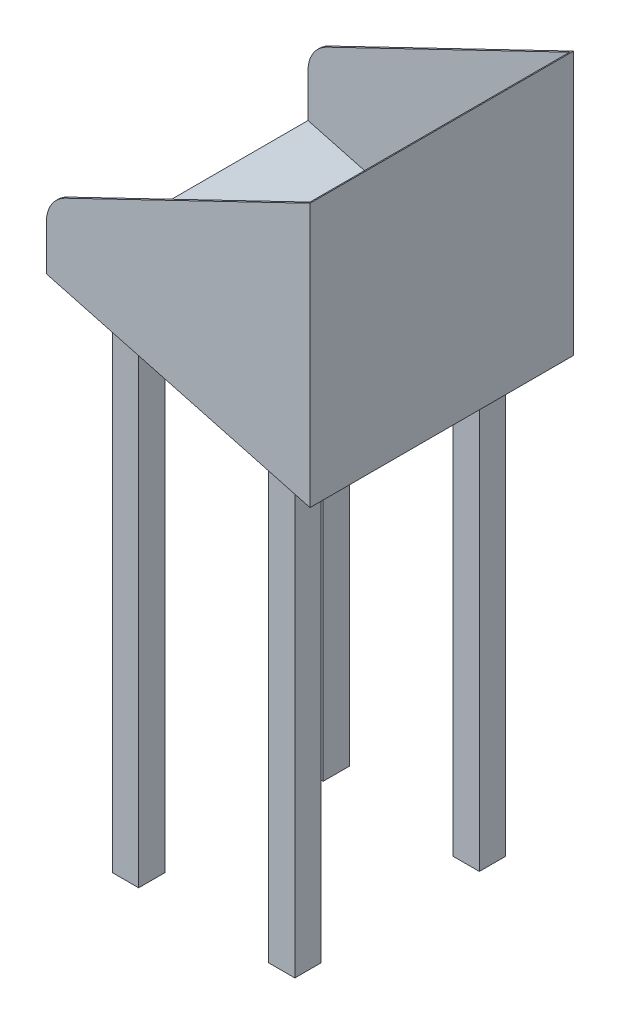
ISO-10303-21;
HEADER;
FILE_DESCRIPTION(('STEP AP214'),'2;1');
FILE_NAME('part.step','',(''),(''),'','','');
FILE_SCHEMA(('AUTOMOTIVE_DESIGN { 1 0 10303 214 1 1 1 1 }'));
ENDSEC;
DATA;
#1=APPLICATION_CONTEXT('core data for automotive mechanical design processes');
#2=APPLICATION_PROTOCOL_DEFINITION('international standard','automotive_design',2000,#1);
#3=PRODUCT_CONTEXT('',#1,'mechanical');
#4=PRODUCT('Part','Part','',(#3));
#5=PRODUCT_RELATED_PRODUCT_CATEGORY('part','',(#4));
#6=PRODUCT_DEFINITION_FORMATION('','',#4);
#7=PRODUCT_DEFINITION_CONTEXT('part definition',#1,'design');
#8=PRODUCT_DEFINITION('design','',#6,#7);
#9=PRODUCT_DEFINITION_SHAPE('','',#8);
#10=(LENGTH_UNIT() NAMED_UNIT(*) SI_UNIT(.MILLI.,.METRE.));
#11=(NAMED_UNIT(*) PLANE_ANGLE_UNIT() SI_UNIT($,.RADIAN.));
#12=(NAMED_UNIT(*) SI_UNIT($,.STERADIAN.) SOLID_ANGLE_UNIT());
#13=UNCERTAINTY_MEASURE_WITH_UNIT(LENGTH_MEASURE(1.E-05),#10,'distance_accuracy_value','');
#14=(GEOMETRIC_REPRESENTATION_CONTEXT(3) GLOBAL_UNCERTAINTY_ASSIGNED_CONTEXT((#13)) GLOBAL_UNIT_ASSIGNED_CONTEXT((#10,
#11,#12)) REPRESENTATION_CONTEXT('',''));
#15=CARTESIAN_POINT('',(0.,0.,0.));
#16=DIRECTION('',(0.,0.,1.));
#17=DIRECTION('',(1.,0.,0.));
#18=AXIS2_PLACEMENT_3D('',#15,#16,#17);
#19=CARTESIAN_POINT('',(-350.,175.77606946893,400.));
#20=DIRECTION('',(0.,0.,1.));
#21=DIRECTION('',(1.,0.,0.));
#22=AXIS2_PLACEMENT_3D('',#19,#20,#21);
#23=CYLINDRICAL_SURFACE('',#22,50.);
#24=DIRECTION('',(0.,0.,1.));
#25=VECTOR('',#24,1.);
#26=CARTESIAN_POINT('',(-371.711595290038,220.816125307723,400.));
#27=LINE('',#26,#25);
#28=CARTESIAN_POINT('',(-371.711595290038,220.816125307723,0.));
#29=VERTEX_POINT('',#28);
#30=CARTESIAN_POINT('',(-371.711595290038,220.816125307723,3.));
#31=VERTEX_POINT('',#30);
#32=EDGE_CURVE('E409',#29,#31,#27,.T.);
#33=ORIENTED_EDGE('',*,*,#32,.F.);
#34=CARTESIAN_POINT('',(-350.,175.77606946893,0.));
#35=DIRECTION('',(0.,0.,-1.));
#36=DIRECTION('',(-1.,0.,0.));
#37=AXIS2_PLACEMENT_3D('',#34,#35,#36);
#38=CIRCLE('',#37,50.);
#39=CARTESIAN_POINT('',(-400.,175.77606946893,0.));
#40=VERTEX_POINT('',#39);
#41=EDGE_CURVE('E40',#40,#29,#38,.T.);
#42=ORIENTED_EDGE('',*,*,#41,.F.);
#43=DIRECTION('',(0.,0.,1.));
#44=VECTOR('',#43,1.);
#45=CARTESIAN_POINT('',(-400.,175.77606946893,400.));
#46=LINE('',#45,#44);
#47=CARTESIAN_POINT('',(-400.,175.77606946893,3.));
#48=VERTEX_POINT('',#47);
#49=EDGE_CURVE('E412',#48,#40,#46,.F.);
#50=ORIENTED_EDGE('',*,*,#49,.F.);
#51=CARTESIAN_POINT('',(-350.,175.77606946893,3.));
#52=DIRECTION('',(0.,0.,-1.));
#53=DIRECTION('',(-1.,0.,0.));
#54=AXIS2_PLACEMENT_3D('',#51,#52,#53);
#55=CIRCLE('',#54,50.);
#56=EDGE_CURVE('E11',#31,#48,#55,.F.);
#57=ORIENTED_EDGE('',*,*,#56,.F.);
#58=EDGE_LOOP('',(#33,#42,#50,#57));
#59=FACE_BOUND('',#58,.T.);
#60=ADVANCED_FACE('F33',(#59),#23,.T.);
#61=CARTESIAN_POINT('',(-350.,175.77606946893,400.));
#62=DIRECTION('',(0.,0.,-1.));
#63=DIRECTION('',(-1.,0.,0.));
#64=AXIS2_PLACEMENT_3D('',#61,#62,#63);
#65=CYLINDRICAL_SURFACE('',#64,50.);
#66=DIRECTION('',(0.,0.,-1.));
#67=VECTOR('',#66,1.);
#68=CARTESIAN_POINT('',(-400.,175.77606946893,400.));
#69=LINE('',#68,#67);
#70=CARTESIAN_POINT('',(-400.,175.77606946893,400.));
#71=VERTEX_POINT('',#70);
#72=CARTESIAN_POINT('',(-400.,175.77606946893,397.));
#73=VERTEX_POINT('',#72);
#74=EDGE_CURVE('E398',#71,#73,#69,.T.);
#75=ORIENTED_EDGE('',*,*,#74,.F.);
#76=CARTESIAN_POINT('',(-350.,175.77606946893,400.));
#77=DIRECTION('',(0.,0.,-1.));
#78=DIRECTION('',(-1.,0.,0.));
#79=AXIS2_PLACEMENT_3D('',#76,#77,#78);
#80=CIRCLE('',#79,50.);
#81=CARTESIAN_POINT('',(-371.711595290038,220.816125307723,400.));
#82=VERTEX_POINT('',#81);
#83=EDGE_CURVE('E407',#82,#71,#80,.F.);
#84=ORIENTED_EDGE('',*,*,#83,.F.);
#85=DIRECTION('',(0.,0.,-1.));
#86=VECTOR('',#85,1.);
#87=CARTESIAN_POINT('',(-371.711595290038,220.816125307723,400.));
#88=LINE('',#87,#86);
#89=CARTESIAN_POINT('',(-371.711595290038,220.816125307723,397.));
#90=VERTEX_POINT('',#89);
#91=EDGE_CURVE('E404',#90,#82,#88,.F.);
#92=ORIENTED_EDGE('',*,*,#91,.F.);
#93=CARTESIAN_POINT('',(-350.,175.77606946893,397.));
#94=DIRECTION('',(0.,0.,-1.));
#95=DIRECTION('',(-1.,0.,0.));
#96=AXIS2_PLACEMENT_3D('',#93,#94,#95);
#97=CIRCLE('',#96,50.);
#98=EDGE_CURVE('E401',#73,#90,#97,.T.);
#99=ORIENTED_EDGE('',*,*,#98,.F.);
#100=EDGE_LOOP('',(#75,#84,#92,#99));
#101=FACE_BOUND('',#100,.T.);
#102=ADVANCED_FACE('F458',(#101),#65,.T.);
#103=CARTESIAN_POINT('',(-400.,207.179676972451,400.));
#104=DIRECTION('',(0.434231905800749,-0.900801116775867,0.));
#105=DIRECTION('',(0.900801116775867,0.434231905800749,0.));
#106=AXIS2_PLACEMENT_3D('',#103,#104,#105);
#107=PLANE('',#106);
#108=DIRECTION('',(-0.900801116775867,-0.434231905800749,0.));
#109=VECTOR('',#108,1.);
#110=CARTESIAN_POINT('',(-400.,207.179676972451,0.));
#111=LINE('',#110,#109);
#112=CARTESIAN_POINT('',(0.,400.,0.));
#113=VERTEX_POINT('',#112);
#114=EDGE_CURVE('E363',#113,#29,#111,.T.);
#115=ORIENTED_EDGE('',*,*,#114,.T.);
#116=ORIENTED_EDGE('',*,*,#32,.T.);
#117=DIRECTION('',(-0.900801116775867,-0.434231905800749,0.));
#118=VECTOR('',#117,1.);
#119=CARTESIAN_POINT('',(-156.462634274011,324.57706079386,3.));
#120=LINE('',#119,#118);
#121=CARTESIAN_POINT('',(-3.,398.553847577293,3.));
#122=VERTEX_POINT('',#121);
#123=EDGE_CURVE('E338',#122,#31,#120,.T.);
#124=ORIENTED_EDGE('',*,*,#123,.F.);
#125=DIRECTION('',(0.,0.,-1.));
#126=VECTOR('',#125,1.);
#127=CARTESIAN_POINT('',(-3.,398.553847577293,400.));
#128=LINE('',#127,#126);
#129=CARTESIAN_POINT('',(-3.,398.553847577293,397.));
#130=VERTEX_POINT('',#129);
#131=EDGE_CURVE('E353',#130,#122,#128,.T.);
#132=ORIENTED_EDGE('',*,*,#131,.F.);
#133=DIRECTION('',(-0.900801116775867,-0.434231905800749,0.));
#134=VECTOR('',#133,1.);
#135=CARTESIAN_POINT('',(-156.462634274011,324.57706079386,397.));
#136=LINE('',#135,#134);
#137=EDGE_CURVE('E359',#130,#90,#136,.T.);
#138=ORIENTED_EDGE('',*,*,#137,.T.);
#139=ORIENTED_EDGE('',*,*,#91,.T.);
#140=DIRECTION('',(-0.900801116775867,-0.434231905800749,0.));
#141=VECTOR('',#140,1.);
#142=CARTESIAN_POINT('',(-400.,207.179676972451,400.));
#143=LINE('',#142,#141);
#144=CARTESIAN_POINT('',(0.,400.,400.));
#145=VERTEX_POINT('',#144);
#146=EDGE_CURVE('E372',#145,#82,#143,.T.);
#147=ORIENTED_EDGE('',*,*,#146,.F.);
#148=DIRECTION('',(0.,0.,-1.));
#149=VECTOR('',#148,1.);
#150=CARTESIAN_POINT('',(0.,400.,400.));
#151=LINE('',#150,#149);
#152=EDGE_CURVE('E382',#145,#113,#151,.T.);
#153=ORIENTED_EDGE('',*,*,#152,.T.);
#154=EDGE_LOOP('',(#115,#116,#124,#132,#138,#139,#147,#153));
#155=FACE_BOUND('',#154,.T.);
#156=ADVANCED_FACE('F425',(#155),#107,.F.);
#157=CARTESIAN_POINT('',(-400.,107.179676972451,400.));
#158=DIRECTION('',(1.,0.,0.));
#159=DIRECTION('',(0.,0.,-1.));
#160=AXIS2_PLACEMENT_3D('',#157,#158,#159);
#161=PLANE('',#160);
#162=DIRECTION('',(0.,-1.,0.));
#163=VECTOR('',#162,1.);
#164=CARTESIAN_POINT('',(-400.,0.,3.));
#165=LINE('',#164,#163);
#166=CARTESIAN_POINT('',(-400.,110.285505513681,3.));
#167=VERTEX_POINT('',#166);
#168=EDGE_CURVE('E348',#48,#167,#165,.T.);
#169=ORIENTED_EDGE('',*,*,#168,.F.);
#170=ORIENTED_EDGE('',*,*,#49,.T.);
#171=DIRECTION('',(0.,-1.,0.));
#172=VECTOR('',#171,1.);
#173=CARTESIAN_POINT('',(-400.,107.179676972451,0.));
#174=LINE('',#173,#172);
#175=CARTESIAN_POINT('',(-400.,107.179676972451,0.));
#176=VERTEX_POINT('',#175);
#177=EDGE_CURVE('E385',#40,#176,#174,.T.);
#178=ORIENTED_EDGE('',*,*,#177,.T.);
#179=DIRECTION('',(0.,0.,-1.));
#180=VECTOR('',#179,1.);
#181=CARTESIAN_POINT('',(-400.,107.179676972451,400.));
#182=LINE('',#181,#180);
#183=CARTESIAN_POINT('',(-400.,107.179676972451,400.));
#184=VERTEX_POINT('',#183);
#185=EDGE_CURVE('E395',#184,#176,#182,.T.);
#186=ORIENTED_EDGE('',*,*,#185,.F.);
#187=DIRECTION('',(0.,-1.,0.));
#188=VECTOR('',#187,1.);
#189=CARTESIAN_POINT('',(-400.,107.179676972451,400.));
#190=LINE('',#189,#188);
#191=EDGE_CURVE('E375',#71,#184,#190,.T.);
#192=ORIENTED_EDGE('',*,*,#191,.F.);
#193=ORIENTED_EDGE('',*,*,#74,.T.);
#194=DIRECTION('',(0.,-1.,0.));
#195=VECTOR('',#194,1.);
#196=CARTESIAN_POINT('',(-400.,0.,397.));
#197=LINE('',#196,#195);
#198=CARTESIAN_POINT('',(-400.,110.285505513681,397.));
#199=VERTEX_POINT('',#198);
#200=EDGE_CURVE('E357',#73,#199,#197,.T.);
#201=ORIENTED_EDGE('',*,*,#200,.T.);
#202=DIRECTION('',(0.,0.,-1.));
#203=VECTOR('',#202,1.);
#204=CARTESIAN_POINT('',(-400.,110.285505513681,400.));
#205=LINE('',#204,#203);
#206=EDGE_CURVE('E352',#199,#167,#205,.T.);
#207=ORIENTED_EDGE('',*,*,#206,.T.);
#208=EDGE_LOOP('',(#169,#170,#178,#186,#192,#193,#201,#207));
#209=FACE_BOUND('',#208,.T.);
#210=ADVANCED_FACE('F438',(#209),#161,.F.);
#211=CARTESIAN_POINT('',(0.,0.,400.));
#212=DIRECTION('',(0.258819045102525,0.965925826289067,0.));
#213=DIRECTION('',(-0.965925826289067,0.258819045102525,0.));
#214=AXIS2_PLACEMENT_3D('',#211,#212,#213);
#215=PLANE('',#214);
#216=DIRECTION('',(-0.965925826289067,0.258819045102525,0.));
#217=VECTOR('',#216,1.);
#218=CARTESIAN_POINT('',(-417.224818643355,111.79505321771,320.));
#219=LINE('',#218,#217);
#220=CARTESIAN_POINT('',(-300.,80.3847577293381,320.));
#221=VERTEX_POINT('',#220);
#222=CARTESIAN_POINT('',(-340.,91.1027254265831,320.));
#223=VERTEX_POINT('',#222);
#224=EDGE_CURVE('E208',#221,#223,#219,.T.);
#225=ORIENTED_EDGE('',*,*,#224,.T.);
#226=DIRECTION('',(0.,0.,1.));
#227=VECTOR('',#226,1.);
#228=CARTESIAN_POINT('',(-340.,91.1027254265832,360.));
#229=LINE('',#228,#227);
#230=CARTESIAN_POINT('',(-340.,91.1027254265831,360.));
#231=VERTEX_POINT('',#230);
#232=EDGE_CURVE('E218',#223,#231,#229,.T.);
#233=ORIENTED_EDGE('',*,*,#232,.T.);
#234=DIRECTION('',(0.965925826289067,-0.258819045102525,0.));
#235=VECTOR('',#234,1.);
#236=CARTESIAN_POINT('',(-417.224818643355,111.79505321771,360.));
#237=LINE('',#236,#235);
#238=CARTESIAN_POINT('',(-300.,80.3847577293381,360.));
#239=VERTEX_POINT('',#238);
#240=EDGE_CURVE('E225',#231,#239,#237,.T.);
#241=ORIENTED_EDGE('',*,*,#240,.T.);
#242=DIRECTION('',(0.,0.,-1.));
#243=VECTOR('',#242,1.);
#244=CARTESIAN_POINT('',(-300.,80.3847577293381,360.));
#245=LINE('',#244,#243);
#246=EDGE_CURVE('E47',#239,#221,#245,.T.);
#247=ORIENTED_EDGE('',*,*,#246,.T.);
#248=EDGE_LOOP('',(#225,#233,#241,#247));
#249=FACE_BOUND('',#248,.T.);
#250=DIRECTION('',(0.965925826289067,-0.258819045102525,0.));
#251=VECTOR('',#250,1.);
#252=CARTESIAN_POINT('',(-158.780300219211,42.5450532177095,360.));
#253=LINE('',#252,#251);
#254=CARTESIAN_POINT('',(-103.,27.598766820406,360.));
#255=VERTEX_POINT('',#254);
#256=CARTESIAN_POINT('',(-62.9999999999999,16.880799123161,360.));
#257=VERTEX_POINT('',#256);
#258=EDGE_CURVE('E214',#255,#257,#253,.T.);
#259=ORIENTED_EDGE('',*,*,#258,.T.);
#260=DIRECTION('',(0.,0.,-1.));
#261=VECTOR('',#260,1.);
#262=CARTESIAN_POINT('',(-62.9999999999999,16.8807991231609,360.));
#263=LINE('',#262,#261);
#264=CARTESIAN_POINT('',(-62.9999999999999,16.880799123161,320.));
#265=VERTEX_POINT('',#264);
#266=EDGE_CURVE('E249',#257,#265,#263,.T.);
#267=ORIENTED_EDGE('',*,*,#266,.T.);
#268=DIRECTION('',(-0.965925826289067,0.258819045102525,0.));
#269=VECTOR('',#268,1.);
#270=CARTESIAN_POINT('',(-158.780300219211,42.5450532177095,320.));
#271=LINE('',#270,#269);
#272=CARTESIAN_POINT('',(-103.,27.598766820406,320.));
#273=VERTEX_POINT('',#272);
#274=EDGE_CURVE('E253',#265,#273,#271,.T.);
#275=ORIENTED_EDGE('',*,*,#274,.T.);
#276=DIRECTION('',(0.,0.,1.));
#277=VECTOR('',#276,1.);
#278=CARTESIAN_POINT('',(-103.,27.5987668204061,360.));
#279=LINE('',#278,#277);
#280=EDGE_CURVE('E55',#273,#255,#279,.T.);
#281=ORIENTED_EDGE('',*,*,#280,.T.);
#282=EDGE_LOOP('',(#259,#267,#275,#281));
#283=FACE_BOUND('',#282,.T.);
#284=DIRECTION('',(0.965925826289067,-0.258819045102525,0.));
#285=VECTOR('',#284,1.);
#286=CARTESIAN_POINT('',(-158.780300219211,42.5450532177095,80.));
#287=LINE('',#286,#285);
#288=CARTESIAN_POINT('',(-103.,27.598766820406,80.));
#289=VERTEX_POINT('',#288);
#290=CARTESIAN_POINT('',(-62.9999999999999,16.880799123161,80.));
#291=VERTEX_POINT('',#290);
#292=EDGE_CURVE('E273',#289,#291,#287,.T.);
#293=ORIENTED_EDGE('',*,*,#292,.T.);
#294=DIRECTION('',(0.,0.,-1.));
#295=VECTOR('',#294,1.);
#296=CARTESIAN_POINT('',(-62.9999999999999,16.8807991231609,40.));
#297=LINE('',#296,#295);
#298=CARTESIAN_POINT('',(-62.9999999999999,16.880799123161,40.));
#299=VERTEX_POINT('',#298);
#300=EDGE_CURVE('E279',#291,#299,#297,.T.);
#301=ORIENTED_EDGE('',*,*,#300,.T.);
#302=DIRECTION('',(-0.965925826289067,0.258819045102525,0.));
#303=VECTOR('',#302,1.);
#304=CARTESIAN_POINT('',(-158.780300219211,42.5450532177095,40.));
#305=LINE('',#304,#303);
#306=CARTESIAN_POINT('',(-103.,27.598766820406,40.));
#307=VERTEX_POINT('',#306);
#308=EDGE_CURVE('E283',#299,#307,#305,.T.);
#309=ORIENTED_EDGE('',*,*,#308,.T.);
#310=DIRECTION('',(0.,0.,1.));
#311=VECTOR('',#310,1.);
#312=CARTESIAN_POINT('',(-103.,27.5987668204061,39.9999999999999));
#313=LINE('',#312,#311);
#314=EDGE_CURVE('E286',#307,#289,#313,.T.);
#315=ORIENTED_EDGE('',*,*,#314,.T.);
#316=EDGE_LOOP('',(#293,#301,#309,#315));
#317=FACE_BOUND('',#316,.T.);
#318=DIRECTION('',(-0.965925826289067,0.258819045102525,0.));
#319=VECTOR('',#318,1.);
#320=CARTESIAN_POINT('',(-417.224818643355,111.79505321771,40.));
#321=LINE('',#320,#319);
#322=CARTESIAN_POINT('',(-300.,80.3847577293381,40.));
#323=VERTEX_POINT('',#322);
#324=CARTESIAN_POINT('',(-340.,91.1027254265831,40.));
#325=VERTEX_POINT('',#324);
#326=EDGE_CURVE('E305',#323,#325,#321,.T.);
#327=ORIENTED_EDGE('',*,*,#326,.T.);
#328=DIRECTION('',(0.,0.,1.));
#329=VECTOR('',#328,1.);
#330=CARTESIAN_POINT('',(-340.,91.1027254265832,40.));
#331=LINE('',#330,#329);
#332=CARTESIAN_POINT('',(-340.,91.1027254265831,80.));
#333=VERTEX_POINT('',#332);
#334=EDGE_CURVE('E312',#325,#333,#331,.T.);
#335=ORIENTED_EDGE('',*,*,#334,.T.);
#336=DIRECTION('',(0.965925826289067,-0.258819045102525,0.));
#337=VECTOR('',#336,1.);
#338=CARTESIAN_POINT('',(-417.224818643355,111.79505321771,80.));
#339=LINE('',#338,#337);
#340=CARTESIAN_POINT('',(-300.,80.3847577293381,80.));
#341=VERTEX_POINT('',#340);
#342=EDGE_CURVE('E316',#333,#341,#339,.T.);
#343=ORIENTED_EDGE('',*,*,#342,.T.);
#344=DIRECTION('',(0.,0.,-1.));
#345=VECTOR('',#344,1.);
#346=CARTESIAN_POINT('',(-300.,80.3847577293382,40.));
#347=LINE('',#346,#345);
#348=EDGE_CURVE('E319',#341,#323,#347,.T.);
#349=ORIENTED_EDGE('',*,*,#348,.T.);
#350=EDGE_LOOP('',(#327,#335,#343,#349));
#351=FACE_BOUND('',#350,.T.);
#352=DIRECTION('',(0.965925826289067,-0.258819045102525,0.));
#353=VECTOR('',#352,1.);
#354=CARTESIAN_POINT('',(0.,0.,0.));
#355=LINE('',#354,#353);
#356=CARTESIAN_POINT('',(0.,0.,0.));
#357=VERTEX_POINT('',#356);
#358=EDGE_CURVE('E387',#176,#357,#355,.T.);
#359=ORIENTED_EDGE('',*,*,#358,.T.);
#360=DIRECTION('',(0.,0.,-1.));
#361=VECTOR('',#360,1.);
#362=CARTESIAN_POINT('',(0.,0.,400.));
#363=LINE('',#362,#361);
#364=CARTESIAN_POINT('',(0.,0.,400.));
#365=VERTEX_POINT('',#364);
#366=EDGE_CURVE('E392',#365,#357,#363,.T.);
#367=ORIENTED_EDGE('',*,*,#366,.F.);
#368=DIRECTION('',(0.965925826289067,-0.258819045102525,0.));
#369=VECTOR('',#368,1.);
#370=CARTESIAN_POINT('',(0.,0.,400.));
#371=LINE('',#370,#369);
#372=EDGE_CURVE('E378',#184,#365,#371,.T.);
#373=ORIENTED_EDGE('',*,*,#372,.F.);
#374=ORIENTED_EDGE('',*,*,#185,.T.);
#375=EDGE_LOOP('',(#359,#367,#373,#374));
#376=FACE_BOUND('',#375,.T.);
#377=ADVANCED_FACE('F227',(#249,#283,#317,#351,#376),#215,.F.);
#378=CARTESIAN_POINT('',(0.,400.,400.));
#379=DIRECTION('',(-1.,0.,0.));
#380=DIRECTION('',(0.,0.,1.));
#381=AXIS2_PLACEMENT_3D('',#378,#379,#380);
#382=PLANE('',#381);
#383=DIRECTION('',(0.,1.,0.));
#384=VECTOR('',#383,1.);
#385=CARTESIAN_POINT('',(0.,400.,0.));
#386=LINE('',#385,#384);
#387=EDGE_CURVE('E376',#357,#113,#386,.T.);
#388=ORIENTED_EDGE('',*,*,#387,.T.);
#389=ORIENTED_EDGE('',*,*,#152,.F.);
#390=DIRECTION('',(0.,1.,0.));
#391=VECTOR('',#390,1.);
#392=CARTESIAN_POINT('',(0.,400.,400.));
#393=LINE('',#392,#391);
#394=EDGE_CURVE('E380',#365,#145,#393,.T.);
#395=ORIENTED_EDGE('',*,*,#394,.F.);
#396=ORIENTED_EDGE('',*,*,#366,.T.);
#397=EDGE_LOOP('',(#388,#389,#395,#396));
#398=FACE_BOUND('',#397,.T.);
#399=ADVANCED_FACE('F430',(#398),#382,.F.);
#400=CARTESIAN_POINT('',(0.,0.,400.));
#401=DIRECTION('',(0.,0.,-1.));
#402=DIRECTION('',(-1.,0.,0.));
#403=AXIS2_PLACEMENT_3D('',#400,#401,#402);
#404=PLANE('',#403);
#405=ORIENTED_EDGE('',*,*,#146,.T.);
#406=ORIENTED_EDGE('',*,*,#83,.T.);
#407=ORIENTED_EDGE('',*,*,#191,.T.);
#408=ORIENTED_EDGE('',*,*,#372,.T.);
#409=ORIENTED_EDGE('',*,*,#394,.T.);
#410=EDGE_LOOP('',(#405,#406,#407,#408,#409));
#411=FACE_BOUND('',#410,.T.);
#412=ADVANCED_FACE('F460',(#411),#404,.F.);
#413=CARTESIAN_POINT('',(0.,0.,0.));
#414=DIRECTION('',(0.,0.,-1.));
#415=DIRECTION('',(-1.,0.,0.));
#416=AXIS2_PLACEMENT_3D('',#413,#414,#415);
#417=PLANE('',#416);
#418=ORIENTED_EDGE('',*,*,#177,.F.);
#419=ORIENTED_EDGE('',*,*,#41,.T.);
#420=ORIENTED_EDGE('',*,*,#114,.F.);
#421=ORIENTED_EDGE('',*,*,#387,.F.);
#422=ORIENTED_EDGE('',*,*,#358,.F.);
#423=EDGE_LOOP('',(#418,#419,#420,#421,#422));
#424=FACE_BOUND('',#423,.T.);
#425=ADVANCED_FACE('F418',(#424),#417,.T.);
#426=CARTESIAN_POINT('',(0.776457135307574,2.8977774788672,400.));
#427=DIRECTION('',(0.258819045102525,0.965925826289067,0.));
#428=DIRECTION('',(-0.965925826289067,0.258819045102525,0.));
#429=AXIS2_PLACEMENT_3D('',#426,#427,#428);
#430=PLANE('',#429);
#431=DIRECTION('',(0.965925826289067,-0.258819045102525,0.));
#432=VECTOR('',#431,1.);
#433=CARTESIAN_POINT('',(0.776457135307574,2.8977774788672,3.));
#434=LINE('',#433,#432);
#435=CARTESIAN_POINT('',(-3.,3.90967611852363,3.));
#436=VERTEX_POINT('',#435);
#437=EDGE_CURVE('E345',#167,#436,#434,.T.);
#438=ORIENTED_EDGE('',*,*,#437,.F.);
#439=ORIENTED_EDGE('',*,*,#206,.F.);
#440=DIRECTION('',(0.965925826289067,-0.258819045102525,0.));
#441=VECTOR('',#440,1.);
#442=CARTESIAN_POINT('',(0.776457135307574,2.8977774788672,397.));
#443=LINE('',#442,#441);
#444=CARTESIAN_POINT('',(-3.,3.90967611852363,397.));
#445=VERTEX_POINT('',#444);
#446=EDGE_CURVE('E354',#199,#445,#443,.T.);
#447=ORIENTED_EDGE('',*,*,#446,.T.);
#448=DIRECTION('',(0.,0.,-1.));
#449=VECTOR('',#448,1.);
#450=CARTESIAN_POINT('',(-3.,3.90967611852366,400.));
#451=LINE('',#450,#449);
#452=EDGE_CURVE('E349',#445,#436,#451,.T.);
#453=ORIENTED_EDGE('',*,*,#452,.T.);
#454=EDGE_LOOP('',(#438,#439,#447,#453));
#455=FACE_BOUND('',#454,.T.);
#456=ADVANCED_FACE('F444',(#455),#430,.T.);
#457=CARTESIAN_POINT('',(-3.,400.,400.));
#458=DIRECTION('',(-1.,0.,0.));
#459=DIRECTION('',(0.,0.,1.));
#460=AXIS2_PLACEMENT_3D('',#457,#458,#459);
#461=PLANE('',#460);
#462=DIRECTION('',(0.,1.,0.));
#463=VECTOR('',#462,1.);
#464=CARTESIAN_POINT('',(-3.,0.,3.));
#465=LINE('',#464,#463);
#466=EDGE_CURVE('E347',#436,#122,#465,.T.);
#467=ORIENTED_EDGE('',*,*,#466,.F.);
#468=ORIENTED_EDGE('',*,*,#452,.F.);
#469=DIRECTION('',(0.,1.,0.));
#470=VECTOR('',#469,1.);
#471=CARTESIAN_POINT('',(-3.,0.,397.));
#472=LINE('',#471,#470);
#473=EDGE_CURVE('E356',#445,#130,#472,.T.);
#474=ORIENTED_EDGE('',*,*,#473,.T.);
#475=ORIENTED_EDGE('',*,*,#131,.T.);
#476=EDGE_LOOP('',(#467,#468,#474,#475));
#477=FACE_BOUND('',#476,.T.);
#478=ADVANCED_FACE('F450',(#477),#461,.T.);
#479=CARTESIAN_POINT('',(0.,0.,397.));
#480=DIRECTION('',(0.,0.,-1.));
#481=DIRECTION('',(-1.,0.,0.));
#482=AXIS2_PLACEMENT_3D('',#479,#480,#481);
#483=PLANE('',#482);
#484=ORIENTED_EDGE('',*,*,#200,.F.);
#485=ORIENTED_EDGE('',*,*,#98,.T.);
#486=ORIENTED_EDGE('',*,*,#137,.F.);
#487=ORIENTED_EDGE('',*,*,#473,.F.);
#488=ORIENTED_EDGE('',*,*,#446,.F.);
#489=EDGE_LOOP('',(#484,#485,#486,#487,#488));
#490=FACE_BOUND('',#489,.T.);
#491=ADVANCED_FACE('F455',(#490),#483,.T.);
#492=CARTESIAN_POINT('',(0.,0.,3.));
#493=DIRECTION('',(0.,0.,-1.));
#494=DIRECTION('',(-1.,0.,0.));
#495=AXIS2_PLACEMENT_3D('',#492,#493,#494);
#496=PLANE('',#495);
#497=ORIENTED_EDGE('',*,*,#123,.T.);
#498=ORIENTED_EDGE('',*,*,#56,.T.);
#499=ORIENTED_EDGE('',*,*,#168,.T.);
#500=ORIENTED_EDGE('',*,*,#437,.T.);
#501=ORIENTED_EDGE('',*,*,#466,.T.);
#502=EDGE_LOOP('',(#497,#498,#499,#500,#501));
#503=FACE_BOUND('',#502,.T.);
#504=ADVANCED_FACE('F442',(#503),#496,.F.);
#505=CARTESIAN_POINT('',(-340.,-669.71,40.));
#506=DIRECTION('',(-1.,0.,0.));
#507=DIRECTION('',(0.,0.,1.));
#508=AXIS2_PLACEMENT_3D('',#505,#506,#507);
#509=PLANE('',#508);
#510=DIRECTION('',(0.,1.,0.));
#511=VECTOR('',#510,1.);
#512=CARTESIAN_POINT('',(-340.,-669.71,80.));
#513=LINE('',#512,#511);
#514=CARTESIAN_POINT('',(-340.,-669.71,80.));
#515=VERTEX_POINT('',#514);
#516=EDGE_CURVE('E335',#515,#333,#513,.T.);
#517=ORIENTED_EDGE('',*,*,#516,.T.);
#518=ORIENTED_EDGE('',*,*,#334,.F.);
#519=DIRECTION('',(0.,1.,0.));
#520=VECTOR('',#519,1.);
#521=CARTESIAN_POINT('',(-340.,-669.71,40.));
#522=LINE('',#521,#520);
#523=CARTESIAN_POINT('',(-340.,-669.71,40.));
#524=VERTEX_POINT('',#523);
#525=EDGE_CURVE('E336',#524,#325,#522,.T.);
#526=ORIENTED_EDGE('',*,*,#525,.F.);
#527=DIRECTION('',(0.,0.,1.));
#528=VECTOR('',#527,1.);
#529=CARTESIAN_POINT('',(-340.,-669.71,40.));
#530=LINE('',#529,#528);
#531=EDGE_CURVE('E315',#524,#515,#530,.T.);
#532=ORIENTED_EDGE('',*,*,#531,.T.);
#533=EDGE_LOOP('',(#517,#518,#526,#532));
#534=FACE_BOUND('',#533,.T.);
#535=ADVANCED_FACE('F492',(#534),#509,.T.);
#536=CARTESIAN_POINT('',(-340.,-669.71,40.));
#537=DIRECTION('',(0.,0.,-1.));
#538=DIRECTION('',(-1.,0.,0.));
#539=AXIS2_PLACEMENT_3D('',#536,#537,#538);
#540=PLANE('',#539);
#541=ORIENTED_EDGE('',*,*,#525,.T.);
#542=ORIENTED_EDGE('',*,*,#326,.F.);
#543=DIRECTION('',(0.,1.,0.));
#544=VECTOR('',#543,1.);
#545=CARTESIAN_POINT('',(-300.,-669.71,40.));
#546=LINE('',#545,#544);
#547=CARTESIAN_POINT('',(-300.,-669.71,40.));
#548=VERTEX_POINT('',#547);
#549=EDGE_CURVE('E339',#548,#323,#546,.T.);
#550=ORIENTED_EDGE('',*,*,#549,.F.);
#551=DIRECTION('',(-1.,0.,0.));
#552=VECTOR('',#551,1.);
#553=CARTESIAN_POINT('',(-340.,-669.71,40.));
#554=LINE('',#553,#552);
#555=EDGE_CURVE('E332',#548,#524,#554,.T.);
#556=ORIENTED_EDGE('',*,*,#555,.T.);
#557=EDGE_LOOP('',(#541,#542,#550,#556));
#558=FACE_BOUND('',#557,.T.);
#559=ADVANCED_FACE('F497',(#558),#540,.T.);
#560=CARTESIAN_POINT('',(-300.,-669.71,40.));
#561=DIRECTION('',(1.,0.,0.));
#562=DIRECTION('',(0.,0.,-1.));
#563=AXIS2_PLACEMENT_3D('',#560,#561,#562);
#564=PLANE('',#563);
#565=ORIENTED_EDGE('',*,*,#549,.T.);
#566=ORIENTED_EDGE('',*,*,#348,.F.);
#567=DIRECTION('',(0.,1.,0.));
#568=VECTOR('',#567,1.);
#569=CARTESIAN_POINT('',(-300.,-669.71,80.));
#570=LINE('',#569,#568);
#571=CARTESIAN_POINT('',(-300.,-669.71,80.));
#572=VERTEX_POINT('',#571);
#573=EDGE_CURVE('E341',#572,#341,#570,.T.);
#574=ORIENTED_EDGE('',*,*,#573,.F.);
#575=DIRECTION('',(0.,0.,-1.));
#576=VECTOR('',#575,1.);
#577=CARTESIAN_POINT('',(-300.,-669.71,40.));
#578=LINE('',#577,#576);
#579=EDGE_CURVE('E329',#572,#548,#578,.T.);
#580=ORIENTED_EDGE('',*,*,#579,.T.);
#581=EDGE_LOOP('',(#565,#566,#574,#580));
#582=FACE_BOUND('',#581,.T.);
#583=ADVANCED_FACE('F508',(#582),#564,.T.);
#584=CARTESIAN_POINT('',(-340.,-669.71,80.));
#585=DIRECTION('',(0.,0.,1.));
#586=DIRECTION('',(1.,0.,0.));
#587=AXIS2_PLACEMENT_3D('',#584,#585,#586);
#588=PLANE('',#587);
#589=ORIENTED_EDGE('',*,*,#573,.T.);
#590=ORIENTED_EDGE('',*,*,#342,.F.);
#591=ORIENTED_EDGE('',*,*,#516,.F.);
#592=DIRECTION('',(1.,0.,0.));
#593=VECTOR('',#592,1.);
#594=CARTESIAN_POINT('',(-340.,-669.71,80.));
#595=LINE('',#594,#593);
#596=EDGE_CURVE('E326',#515,#572,#595,.T.);
#597=ORIENTED_EDGE('',*,*,#596,.T.);
#598=EDGE_LOOP('',(#589,#590,#591,#597));
#599=FACE_BOUND('',#598,.T.);
#600=ADVANCED_FACE('F518',(#599),#588,.T.);
#601=CARTESIAN_POINT('',(0.,-669.71,0.));
#602=DIRECTION('',(0.,1.,0.));
#603=DIRECTION('',(0.,0.,1.));
#604=AXIS2_PLACEMENT_3D('',#601,#602,#603);
#605=PLANE('',#604);
#606=CARTESIAN_POINT('',(-320.,-669.71,60.));
#607=DIRECTION('',(0.,-1.,0.));
#608=DIRECTION('',(0.,0.,-1.));
#609=AXIS2_PLACEMENT_3D('',#606,#607,#608);
#610=CIRCLE('',#609,7.50000000000001);
#611=CARTESIAN_POINT('',(-320.,-669.71,52.5));
#612=VERTEX_POINT('',#611);
#613=EDGE_CURVE('E825',#612,#612,#610,.T.);
#614=ORIENTED_EDGE('',*,*,#613,.F.);
#615=EDGE_LOOP('',(#614));
#616=FACE_BOUND('',#615,.T.);
#617=ORIENTED_EDGE('',*,*,#531,.F.);
#618=ORIENTED_EDGE('',*,*,#555,.F.);
#619=ORIENTED_EDGE('',*,*,#579,.F.);
#620=ORIENTED_EDGE('',*,*,#596,.F.);
#621=EDGE_LOOP('',(#617,#618,#619,#620));
#622=FACE_BOUND('',#621,.T.);
#623=ADVANCED_FACE('F528',(#616,#622),#605,.F.);
#624=CARTESIAN_POINT('',(-62.9999999999999,-669.71,40.));
#625=DIRECTION('',(1.,0.,0.));
#626=DIRECTION('',(0.,0.,-1.));
#627=AXIS2_PLACEMENT_3D('',#624,#625,#626);
#628=PLANE('',#627);
#629=DIRECTION('',(0.,1.,0.));
#630=VECTOR('',#629,1.);
#631=CARTESIAN_POINT('',(-62.9999999999999,-669.71,40.));
#632=LINE('',#631,#630);
#633=CARTESIAN_POINT('',(-62.9999999999999,-669.71,40.));
#634=VERTEX_POINT('',#633);
#635=EDGE_CURVE('E302',#634,#299,#632,.T.);
#636=ORIENTED_EDGE('',*,*,#635,.T.);
#637=ORIENTED_EDGE('',*,*,#300,.F.);
#638=DIRECTION('',(0.,1.,0.));
#639=VECTOR('',#638,1.);
#640=CARTESIAN_POINT('',(-62.9999999999999,-669.71,80.));
#641=LINE('',#640,#639);
#642=CARTESIAN_POINT('',(-62.9999999999999,-669.71,80.));
#643=VERTEX_POINT('',#642);
#644=EDGE_CURVE('E303',#643,#291,#641,.T.);
#645=ORIENTED_EDGE('',*,*,#644,.F.);
#646=DIRECTION('',(0.,0.,-1.));
#647=VECTOR('',#646,1.);
#648=CARTESIAN_POINT('',(-62.9999999999999,-669.71,40.));
#649=LINE('',#648,#647);
#650=EDGE_CURVE('E282',#643,#634,#649,.T.);
#651=ORIENTED_EDGE('',*,*,#650,.T.);
#652=EDGE_LOOP('',(#636,#637,#645,#651));
#653=FACE_BOUND('',#652,.T.);
#654=ADVANCED_FACE('F536',(#653),#628,.T.);
#655=CARTESIAN_POINT('',(-62.9999999999999,-669.71,80.));
#656=DIRECTION('',(0.,0.,1.));
#657=DIRECTION('',(1.,0.,0.));
#658=AXIS2_PLACEMENT_3D('',#655,#656,#657);
#659=PLANE('',#658);
#660=ORIENTED_EDGE('',*,*,#644,.T.);
#661=ORIENTED_EDGE('',*,*,#292,.F.);
#662=DIRECTION('',(0.,1.,0.));
#663=VECTOR('',#662,1.);
#664=CARTESIAN_POINT('',(-103.,-669.71,80.));
#665=LINE('',#664,#663);
#666=CARTESIAN_POINT('',(-103.,-669.71,80.));
#667=VERTEX_POINT('',#666);
#668=EDGE_CURVE('E306',#667,#289,#665,.T.);
#669=ORIENTED_EDGE('',*,*,#668,.F.);
#670=DIRECTION('',(1.,0.,0.));
#671=VECTOR('',#670,1.);
#672=CARTESIAN_POINT('',(-62.9999999999999,-669.71,80.));
#673=LINE('',#672,#671);
#674=EDGE_CURVE('E299',#667,#643,#673,.T.);
#675=ORIENTED_EDGE('',*,*,#674,.T.);
#676=EDGE_LOOP('',(#660,#661,#669,#675));
#677=FACE_BOUND('',#676,.T.);
#678=ADVANCED_FACE('F541',(#677),#659,.T.);
#679=CARTESIAN_POINT('',(-103.,-669.71,40.));
#680=DIRECTION('',(-1.,0.,0.));
#681=DIRECTION('',(0.,0.,1.));
#682=AXIS2_PLACEMENT_3D('',#679,#680,#681);
#683=PLANE('',#682);
#684=ORIENTED_EDGE('',*,*,#668,.T.);
#685=ORIENTED_EDGE('',*,*,#314,.F.);
#686=DIRECTION('',(0.,1.,0.));
#687=VECTOR('',#686,1.);
#688=CARTESIAN_POINT('',(-103.,-669.71,40.));
#689=LINE('',#688,#687);
#690=CARTESIAN_POINT('',(-103.,-669.71,40.));
#691=VERTEX_POINT('',#690);
#692=EDGE_CURVE('E308',#691,#307,#689,.T.);
#693=ORIENTED_EDGE('',*,*,#692,.F.);
#694=DIRECTION('',(0.,0.,1.));
#695=VECTOR('',#694,1.);
#696=CARTESIAN_POINT('',(-103.,-669.71,40.));
#697=LINE('',#696,#695);
#698=EDGE_CURVE('E296',#691,#667,#697,.T.);
#699=ORIENTED_EDGE('',*,*,#698,.T.);
#700=EDGE_LOOP('',(#684,#685,#693,#699));
#701=FACE_BOUND('',#700,.T.);
#702=ADVANCED_FACE('F551',(#701),#683,.T.);
#703=CARTESIAN_POINT('',(-62.9999999999999,-669.71,40.));
#704=DIRECTION('',(0.,0.,-1.));
#705=DIRECTION('',(-1.,0.,0.));
#706=AXIS2_PLACEMENT_3D('',#703,#704,#705);
#707=PLANE('',#706);
#708=ORIENTED_EDGE('',*,*,#692,.T.);
#709=ORIENTED_EDGE('',*,*,#308,.F.);
#710=ORIENTED_EDGE('',*,*,#635,.F.);
#711=DIRECTION('',(-1.,0.,0.));
#712=VECTOR('',#711,1.);
#713=CARTESIAN_POINT('',(-62.9999999999999,-669.71,40.));
#714=LINE('',#713,#712);
#715=EDGE_CURVE('E293',#634,#691,#714,.T.);
#716=ORIENTED_EDGE('',*,*,#715,.T.);
#717=EDGE_LOOP('',(#708,#709,#710,#716));
#718=FACE_BOUND('',#717,.T.);
#719=ADVANCED_FACE('F561',(#718),#707,.T.);
#720=CARTESIAN_POINT('',(0.,-669.71,0.));
#721=DIRECTION('',(0.,-1.,0.));
#722=DIRECTION('',(0.,0.,-1.));
#723=AXIS2_PLACEMENT_3D('',#720,#721,#722);
#724=PLANE('',#723);
#725=CARTESIAN_POINT('',(-82.9999999999999,-669.71,60.));
#726=DIRECTION('',(0.,-1.,0.));
#727=DIRECTION('',(0.,0.,-1.));
#728=AXIS2_PLACEMENT_3D('',#725,#726,#727);
#729=CIRCLE('',#728,7.5);
#730=CARTESIAN_POINT('',(-82.9999999999999,-669.71,52.5));
#731=VERTEX_POINT('',#730);
#732=EDGE_CURVE('E844',#731,#731,#729,.T.);
#733=ORIENTED_EDGE('',*,*,#732,.F.);
#734=EDGE_LOOP('',(#733));
#735=FACE_BOUND('',#734,.T.);
#736=ORIENTED_EDGE('',*,*,#650,.F.);
#737=ORIENTED_EDGE('',*,*,#674,.F.);
#738=ORIENTED_EDGE('',*,*,#698,.F.);
#739=ORIENTED_EDGE('',*,*,#715,.F.);
#740=EDGE_LOOP('',(#736,#737,#738,#739));
#741=FACE_BOUND('',#740,.T.);
#742=ADVANCED_FACE('F571',(#735,#741),#724,.T.);
#743=CARTESIAN_POINT('',(-62.9999999999999,-669.71,360.));
#744=DIRECTION('',(1.,0.,0.));
#745=DIRECTION('',(0.,0.,-1.));
#746=AXIS2_PLACEMENT_3D('',#743,#744,#745);
#747=PLANE('',#746);
#748=DIRECTION('',(0.,1.,0.));
#749=VECTOR('',#748,1.);
#750=CARTESIAN_POINT('',(-62.9999999999999,-669.71,320.));
#751=LINE('',#750,#749);
#752=CARTESIAN_POINT('',(-62.9999999999999,-669.71,320.));
#753=VERTEX_POINT('',#752);
#754=EDGE_CURVE('E270',#753,#265,#751,.T.);
#755=ORIENTED_EDGE('',*,*,#754,.T.);
#756=ORIENTED_EDGE('',*,*,#266,.F.);
#757=DIRECTION('',(0.,1.,0.));
#758=VECTOR('',#757,1.);
#759=CARTESIAN_POINT('',(-62.9999999999999,-669.71,360.));
#760=LINE('',#759,#758);
#761=CARTESIAN_POINT('',(-62.9999999999999,-669.71,360.));
#762=VERTEX_POINT('',#761);
#763=EDGE_CURVE('E271',#762,#257,#760,.T.);
#764=ORIENTED_EDGE('',*,*,#763,.F.);
#765=DIRECTION('',(0.,0.,-1.));
#766=VECTOR('',#765,1.);
#767=CARTESIAN_POINT('',(-62.9999999999999,-669.71,360.));
#768=LINE('',#767,#766);
#769=EDGE_CURVE('E252',#762,#753,#768,.T.);
#770=ORIENTED_EDGE('',*,*,#769,.T.);
#771=EDGE_LOOP('',(#755,#756,#764,#770));
#772=FACE_BOUND('',#771,.T.);
#773=ADVANCED_FACE('F579',(#772),#747,.T.);
#774=CARTESIAN_POINT('',(-62.9999999999999,-669.71,360.));
#775=DIRECTION('',(0.,0.,1.));
#776=DIRECTION('',(1.,0.,0.));
#777=AXIS2_PLACEMENT_3D('',#774,#775,#776);
#778=PLANE('',#777);
#779=ORIENTED_EDGE('',*,*,#763,.T.);
#780=ORIENTED_EDGE('',*,*,#258,.F.);
#781=DIRECTION('',(0.,1.,0.));
#782=VECTOR('',#781,1.);
#783=CARTESIAN_POINT('',(-103.,-669.71,360.));
#784=LINE('',#783,#782);
#785=CARTESIAN_POINT('',(-103.,-669.71,360.));
#786=VERTEX_POINT('',#785);
#787=EDGE_CURVE('E274',#786,#255,#784,.T.);
#788=ORIENTED_EDGE('',*,*,#787,.F.);
#789=DIRECTION('',(1.,0.,0.));
#790=VECTOR('',#789,1.);
#791=CARTESIAN_POINT('',(-62.9999999999999,-669.71,360.));
#792=LINE('',#791,#790);
#793=EDGE_CURVE('E267',#786,#762,#792,.T.);
#794=ORIENTED_EDGE('',*,*,#793,.T.);
#795=EDGE_LOOP('',(#779,#780,#788,#794));
#796=FACE_BOUND('',#795,.T.);
#797=ADVANCED_FACE('F584',(#796),#778,.T.);
#798=CARTESIAN_POINT('',(-103.,-669.71,360.));
#799=DIRECTION('',(-1.,0.,0.));
#800=DIRECTION('',(0.,0.,1.));
#801=AXIS2_PLACEMENT_3D('',#798,#799,#800);
#802=PLANE('',#801);
#803=ORIENTED_EDGE('',*,*,#787,.T.);
#804=ORIENTED_EDGE('',*,*,#280,.F.);
#805=DIRECTION('',(0.,1.,0.));
#806=VECTOR('',#805,1.);
#807=CARTESIAN_POINT('',(-103.,-669.71,320.));
#808=LINE('',#807,#806);
#809=CARTESIAN_POINT('',(-103.,-669.71,320.));
#810=VERTEX_POINT('',#809);
#811=EDGE_CURVE('E276',#810,#273,#808,.T.);
#812=ORIENTED_EDGE('',*,*,#811,.F.);
#813=DIRECTION('',(0.,0.,1.));
#814=VECTOR('',#813,1.);
#815=CARTESIAN_POINT('',(-103.,-669.71,360.));
#816=LINE('',#815,#814);
#817=EDGE_CURVE('E264',#810,#786,#816,.T.);
#818=ORIENTED_EDGE('',*,*,#817,.T.);
#819=EDGE_LOOP('',(#803,#804,#812,#818));
#820=FACE_BOUND('',#819,.T.);
#821=ADVANCED_FACE('F594',(#820),#802,.T.);
#822=CARTESIAN_POINT('',(-62.9999999999999,-669.71,320.));
#823=DIRECTION('',(0.,0.,-1.));
#824=DIRECTION('',(-1.,0.,0.));
#825=AXIS2_PLACEMENT_3D('',#822,#823,#824);
#826=PLANE('',#825);
#827=ORIENTED_EDGE('',*,*,#811,.T.);
#828=ORIENTED_EDGE('',*,*,#274,.F.);
#829=ORIENTED_EDGE('',*,*,#754,.F.);
#830=DIRECTION('',(-1.,0.,0.));
#831=VECTOR('',#830,1.);
#832=CARTESIAN_POINT('',(-62.9999999999999,-669.71,320.));
#833=LINE('',#832,#831);
#834=EDGE_CURVE('E261',#753,#810,#833,.T.);
#835=ORIENTED_EDGE('',*,*,#834,.T.);
#836=EDGE_LOOP('',(#827,#828,#829,#835));
#837=FACE_BOUND('',#836,.T.);
#838=ADVANCED_FACE('F604',(#837),#826,.T.);
#839=CARTESIAN_POINT('',(0.,-669.71,0.));
#840=DIRECTION('',(0.,1.,0.));
#841=DIRECTION('',(0.,0.,1.));
#842=AXIS2_PLACEMENT_3D('',#839,#840,#841);
#843=PLANE('',#842);
#844=CARTESIAN_POINT('',(-82.9999999999999,-669.71,340.));
#845=DIRECTION('',(0.,-1.,0.));
#846=DIRECTION('',(0.,0.,-1.));
#847=AXIS2_PLACEMENT_3D('',#844,#845,#846);
#848=CIRCLE('',#847,7.5);
#849=CARTESIAN_POINT('',(-82.9999999999999,-669.71,332.5));
#850=VERTEX_POINT('',#849);
#851=EDGE_CURVE('E824',#850,#850,#848,.T.);
#852=ORIENTED_EDGE('',*,*,#851,.F.);
#853=EDGE_LOOP('',(#852));
#854=FACE_BOUND('',#853,.T.);
#855=ORIENTED_EDGE('',*,*,#769,.F.);
#856=ORIENTED_EDGE('',*,*,#793,.F.);
#857=ORIENTED_EDGE('',*,*,#817,.F.);
#858=ORIENTED_EDGE('',*,*,#834,.F.);
#859=EDGE_LOOP('',(#855,#856,#857,#858));
#860=FACE_BOUND('',#859,.T.);
#861=ADVANCED_FACE('F613',(#854,#860),#843,.F.);
#862=CARTESIAN_POINT('',(-340.,-669.71,360.));
#863=DIRECTION('',(-1.,0.,0.));
#864=DIRECTION('',(0.,0.,1.));
#865=AXIS2_PLACEMENT_3D('',#862,#863,#864);
#866=PLANE('',#865);
#867=DIRECTION('',(0.,1.,0.));
#868=VECTOR('',#867,1.);
#869=CARTESIAN_POINT('',(-340.,-669.71,360.));
#870=LINE('',#869,#868);
#871=CARTESIAN_POINT('',(-340.,-669.71,360.));
#872=VERTEX_POINT('',#871);
#873=EDGE_CURVE('E220',#872,#231,#870,.T.);
#874=ORIENTED_EDGE('',*,*,#873,.T.);
#875=ORIENTED_EDGE('',*,*,#232,.F.);
#876=DIRECTION('',(0.,1.,0.));
#877=VECTOR('',#876,1.);
#878=CARTESIAN_POINT('',(-340.,-669.71,320.));
#879=LINE('',#878,#877);
#880=CARTESIAN_POINT('',(-340.,-669.71,320.));
#881=VERTEX_POINT('',#880);
#882=EDGE_CURVE('E204',#881,#223,#879,.T.);
#883=ORIENTED_EDGE('',*,*,#882,.F.);
#884=DIRECTION('',(0.,0.,1.));
#885=VECTOR('',#884,1.);
#886=CARTESIAN_POINT('',(-340.,-669.71,360.));
#887=LINE('',#886,#885);
#888=EDGE_CURVE('E224',#881,#872,#887,.T.);
#889=ORIENTED_EDGE('',*,*,#888,.T.);
#890=EDGE_LOOP('',(#874,#875,#883,#889));
#891=FACE_BOUND('',#890,.T.);
#892=ADVANCED_FACE('F219',(#891),#866,.T.);
#893=CARTESIAN_POINT('',(-340.,-669.71,320.));
#894=DIRECTION('',(0.,0.,-1.));
#895=DIRECTION('',(-1.,0.,0.));
#896=AXIS2_PLACEMENT_3D('',#893,#894,#895);
#897=PLANE('',#896);
#898=ORIENTED_EDGE('',*,*,#882,.T.);
#899=ORIENTED_EDGE('',*,*,#224,.F.);
#900=DIRECTION('',(0.,1.,0.));
#901=VECTOR('',#900,1.);
#902=CARTESIAN_POINT('',(-300.,-669.71,320.));
#903=LINE('',#902,#901);
#904=CARTESIAN_POINT('',(-300.,-669.71,320.));
#905=VERTEX_POINT('',#904);
#906=EDGE_CURVE('E215',#905,#221,#903,.T.);
#907=ORIENTED_EDGE('',*,*,#906,.F.);
#908=DIRECTION('',(-1.,0.,0.));
#909=VECTOR('',#908,1.);
#910=CARTESIAN_POINT('',(-340.,-669.71,320.));
#911=LINE('',#910,#909);
#912=EDGE_CURVE('E210',#905,#881,#911,.T.);
#913=ORIENTED_EDGE('',*,*,#912,.T.);
#914=EDGE_LOOP('',(#898,#899,#907,#913));
#915=FACE_BOUND('',#914,.T.);
#916=ADVANCED_FACE('F206',(#915),#897,.T.);
#917=CARTESIAN_POINT('',(-300.,-669.71,360.));
#918=DIRECTION('',(1.,0.,0.));
#919=DIRECTION('',(0.,0.,-1.));
#920=AXIS2_PLACEMENT_3D('',#917,#918,#919);
#921=PLANE('',#920);
#922=ORIENTED_EDGE('',*,*,#906,.T.);
#923=ORIENTED_EDGE('',*,*,#246,.F.);
#924=DIRECTION('',(0.,1.,0.));
#925=VECTOR('',#924,1.);
#926=CARTESIAN_POINT('',(-300.,-669.71,360.));
#927=LINE('',#926,#925);
#928=CARTESIAN_POINT('',(-300.,-669.71,360.));
#929=VERTEX_POINT('',#928);
#930=EDGE_CURVE('E246',#929,#239,#927,.T.);
#931=ORIENTED_EDGE('',*,*,#930,.F.);
#932=DIRECTION('',(0.,0.,-1.));
#933=VECTOR('',#932,1.);
#934=CARTESIAN_POINT('',(-300.,-669.71,360.));
#935=LINE('',#934,#933);
#936=EDGE_CURVE('E241',#929,#905,#935,.T.);
#937=ORIENTED_EDGE('',*,*,#936,.T.);
#938=EDGE_LOOP('',(#922,#923,#931,#937));
#939=FACE_BOUND('',#938,.T.);
#940=ADVANCED_FACE('F633',(#939),#921,.T.);
#941=CARTESIAN_POINT('',(-340.,-669.71,360.));
#942=DIRECTION('',(0.,0.,1.));
#943=DIRECTION('',(1.,0.,0.));
#944=AXIS2_PLACEMENT_3D('',#941,#942,#943);
#945=PLANE('',#944);
#946=ORIENTED_EDGE('',*,*,#930,.T.);
#947=ORIENTED_EDGE('',*,*,#240,.F.);
#948=ORIENTED_EDGE('',*,*,#873,.F.);
#949=DIRECTION('',(1.,0.,0.));
#950=VECTOR('',#949,1.);
#951=CARTESIAN_POINT('',(-340.,-669.71,360.));
#952=LINE('',#951,#950);
#953=EDGE_CURVE('E238',#872,#929,#952,.T.);
#954=ORIENTED_EDGE('',*,*,#953,.T.);
#955=EDGE_LOOP('',(#946,#947,#948,#954));
#956=FACE_BOUND('',#955,.T.);
#957=ADVANCED_FACE('F642',(#956),#945,.T.);
#958=CARTESIAN_POINT('',(0.,-669.71,0.));
#959=DIRECTION('',(0.,-1.,0.));
#960=DIRECTION('',(0.,0.,-1.));
#961=AXIS2_PLACEMENT_3D('',#958,#959,#960);
#962=PLANE('',#961);
#963=CARTESIAN_POINT('',(-320.,-669.71,340.));
#964=DIRECTION('',(0.,-1.,0.));
#965=DIRECTION('',(0.,0.,-1.));
#966=AXIS2_PLACEMENT_3D('',#963,#964,#965);
#967=CIRCLE('',#966,7.50000000000001);
#968=CARTESIAN_POINT('',(-320.,-669.71,332.5));
#969=VERTEX_POINT('',#968);
#970=EDGE_CURVE('E233',#969,#969,#967,.T.);
#971=ORIENTED_EDGE('',*,*,#970,.F.);
#972=EDGE_LOOP('',(#971));
#973=FACE_BOUND('',#972,.T.);
#974=ORIENTED_EDGE('',*,*,#888,.F.);
#975=ORIENTED_EDGE('',*,*,#912,.F.);
#976=ORIENTED_EDGE('',*,*,#936,.F.);
#977=ORIENTED_EDGE('',*,*,#953,.F.);
#978=EDGE_LOOP('',(#974,#975,#976,#977));
#979=FACE_BOUND('',#978,.T.);
#980=ADVANCED_FACE('F651',(#973,#979),#962,.T.);
#981=CARTESIAN_POINT('',(-320.,-649.71,340.));
#982=DIRECTION('',(0.,-1.,0.));
#983=DIRECTION('',(0.,0.,-1.));
#984=AXIS2_PLACEMENT_3D('',#981,#982,#983);
#985=CYLINDRICAL_SURFACE('',#984,7.50000000000001);
#986=CARTESIAN_POINT('',(-320.,-649.71,340.));
#987=DIRECTION('',(0.,-1.,0.));
#988=DIRECTION('',(0.,0.,-1.));
#989=AXIS2_PLACEMENT_3D('',#986,#987,#988);
#990=CIRCLE('',#989,7.50000000000001);
#991=CARTESIAN_POINT('',(-320.,-649.71,332.5));
#992=VERTEX_POINT('',#991);
#993=EDGE_CURVE('E229',#992,#992,#990,.T.);
#994=ORIENTED_EDGE('',*,*,#993,.F.);
#995=EDGE_LOOP('',(#994));
#996=FACE_BOUND('',#995,.T.);
#997=ORIENTED_EDGE('',*,*,#970,.T.);
#998=EDGE_LOOP('',(#997));
#999=FACE_BOUND('',#998,.T.);
#1000=ADVANCED_FACE('F676',(#996,#999),#985,.F.);
#1001=CARTESIAN_POINT('',(-320.,-649.71,340.));
#1002=DIRECTION('',(0.,-1.,0.));
#1003=DIRECTION('',(0.,0.,-1.));
#1004=AXIS2_PLACEMENT_3D('',#1001,#1002,#1003);
#1005=PLANE('',#1004);
#1006=ORIENTED_EDGE('',*,*,#993,.T.);
#1007=EDGE_LOOP('',(#1006));
#1008=FACE_BOUND('',#1007,.T.);
#1009=ADVANCED_FACE('F684',(#1008),#1005,.T.);
#1010=CARTESIAN_POINT('',(-82.9999999999999,-649.71,340.));
#1011=DIRECTION('',(0.,-1.,0.));
#1012=DIRECTION('',(0.,0.,-1.));
#1013=AXIS2_PLACEMENT_3D('',#1010,#1011,#1012);
#1014=CYLINDRICAL_SURFACE('',#1013,7.5);
#1015=CARTESIAN_POINT('',(-82.9999999999999,-649.71,340.));
#1016=DIRECTION('',(0.,-1.,0.));
#1017=DIRECTION('',(0.,0.,-1.));
#1018=AXIS2_PLACEMENT_3D('',#1015,#1016,#1017);
#1019=CIRCLE('',#1018,7.5);
#1020=CARTESIAN_POINT('',(-82.9999999999999,-649.71,332.5));
#1021=VERTEX_POINT('',#1020);
#1022=EDGE_CURVE('E828',#1021,#1021,#1019,.T.);
#1023=ORIENTED_EDGE('',*,*,#1022,.F.);
#1024=EDGE_LOOP('',(#1023));
#1025=FACE_BOUND('',#1024,.T.);
#1026=ORIENTED_EDGE('',*,*,#851,.T.);
#1027=EDGE_LOOP('',(#1026));
#1028=FACE_BOUND('',#1027,.T.);
#1029=ADVANCED_FACE('F694',(#1025,#1028),#1014,.F.);
#1030=CARTESIAN_POINT('',(-82.9999999999999,-649.71,340.));
#1031=DIRECTION('',(0.,-1.,0.));
#1032=DIRECTION('',(0.,0.,-1.));
#1033=AXIS2_PLACEMENT_3D('',#1030,#1031,#1032);
#1034=PLANE('',#1033);
#1035=ORIENTED_EDGE('',*,*,#1022,.T.);
#1036=EDGE_LOOP('',(#1035));
#1037=FACE_BOUND('',#1036,.T.);
#1038=ADVANCED_FACE('F704',(#1037),#1034,.T.);
#1039=CARTESIAN_POINT('',(-82.9999999999999,-649.71,60.));
#1040=DIRECTION('',(0.,-1.,0.));
#1041=DIRECTION('',(0.,0.,-1.));
#1042=AXIS2_PLACEMENT_3D('',#1039,#1040,#1041);
#1043=CYLINDRICAL_SURFACE('',#1042,7.5);
#1044=CARTESIAN_POINT('',(-82.9999999999999,-649.71,60.));
#1045=DIRECTION('',(0.,-1.,0.));
#1046=DIRECTION('',(0.,0.,-1.));
#1047=AXIS2_PLACEMENT_3D('',#1044,#1045,#1046);
#1048=CIRCLE('',#1047,7.5);
#1049=CARTESIAN_POINT('',(-82.9999999999999,-649.71,52.5));
#1050=VERTEX_POINT('',#1049);
#1051=EDGE_CURVE('E831',#1050,#1050,#1048,.T.);
#1052=ORIENTED_EDGE('',*,*,#1051,.F.);
#1053=EDGE_LOOP('',(#1052));
#1054=FACE_BOUND('',#1053,.T.);
#1055=ORIENTED_EDGE('',*,*,#732,.T.);
#1056=EDGE_LOOP('',(#1055));
#1057=FACE_BOUND('',#1056,.T.);
#1058=ADVANCED_FACE('F714',(#1054,#1057),#1043,.F.);
#1059=CARTESIAN_POINT('',(-82.9999999999999,-649.71,60.));
#1060=DIRECTION('',(0.,-1.,0.));
#1061=DIRECTION('',(0.,0.,-1.));
#1062=AXIS2_PLACEMENT_3D('',#1059,#1060,#1061);
#1063=PLANE('',#1062);
#1064=ORIENTED_EDGE('',*,*,#1051,.T.);
#1065=EDGE_LOOP('',(#1064));
#1066=FACE_BOUND('',#1065,.T.);
#1067=ADVANCED_FACE('F724',(#1066),#1063,.T.);
#1068=CARTESIAN_POINT('',(-320.,-649.71,60.));
#1069=DIRECTION('',(0.,-1.,0.));
#1070=DIRECTION('',(0.,0.,-1.));
#1071=AXIS2_PLACEMENT_3D('',#1068,#1069,#1070);
#1072=CYLINDRICAL_SURFACE('',#1071,7.50000000000001);
#1073=CARTESIAN_POINT('',(-320.,-649.71,60.));
#1074=DIRECTION('',(0.,-1.,0.));
#1075=DIRECTION('',(0.,0.,-1.));
#1076=AXIS2_PLACEMENT_3D('',#1073,#1074,#1075);
#1077=CIRCLE('',#1076,7.50000000000001);
#1078=CARTESIAN_POINT('',(-320.,-649.71,52.5));
#1079=VERTEX_POINT('',#1078);
#1080=EDGE_CURVE('E823',#1079,#1079,#1077,.T.);
#1081=ORIENTED_EDGE('',*,*,#1080,.F.);
#1082=EDGE_LOOP('',(#1081));
#1083=FACE_BOUND('',#1082,.T.);
#1084=ORIENTED_EDGE('',*,*,#613,.T.);
#1085=EDGE_LOOP('',(#1084));
#1086=FACE_BOUND('',#1085,.T.);
#1087=ADVANCED_FACE('F734',(#1083,#1086),#1072,.F.);
#1088=CARTESIAN_POINT('',(-320.,-649.71,60.));
#1089=DIRECTION('',(0.,-1.,0.));
#1090=DIRECTION('',(0.,0.,-1.));
#1091=AXIS2_PLACEMENT_3D('',#1088,#1089,#1090);
#1092=PLANE('',#1091);
#1093=ORIENTED_EDGE('',*,*,#1080,.T.);
#1094=EDGE_LOOP('',(#1093));
#1095=FACE_BOUND('',#1094,.T.);
#1096=ADVANCED_FACE('F744',(#1095),#1092,.T.);
#1097=CLOSED_SHELL('',(#60,#102,#156,#210,#377,#399,#412,#425,#456,#478,#491,#504,#535,#559,
#583,#600,#623,#654,#678,#702,#719,#742,#773,#797,#821,#838,#861,#892,#916,#940,#957,#980,#1000,
#1009,#1029,#1038,#1058,#1067,#1087,#1096));
#1098=MANIFOLD_SOLID_BREP('B2',#1097);
#1099=ADVANCED_BREP_SHAPE_REPRESENTATION('',(#18,#1098),#14);
#1100=SHAPE_DEFINITION_REPRESENTATION(#9,#1099);
ENDSEC;
END-ISO-10303-21;
